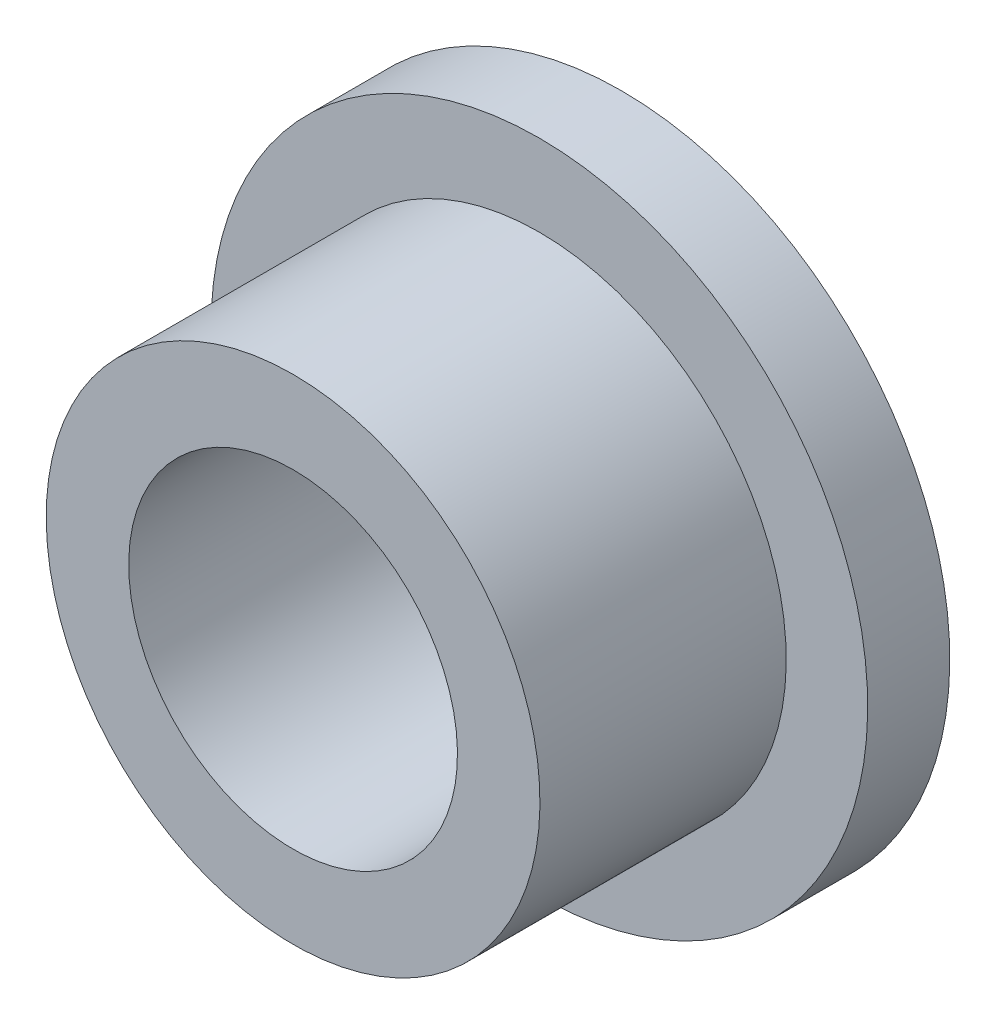
ISO-10303-21;
HEADER;
FILE_DESCRIPTION(('STEP AP214'),'2;1');
FILE_NAME('part.step','',(''),(''),'','','');
FILE_SCHEMA(('AUTOMOTIVE_DESIGN { 1 0 10303 214 1 1 1 1 }'));
ENDSEC;
DATA;
#1=APPLICATION_CONTEXT('core data for automotive mechanical design processes');
#2=APPLICATION_PROTOCOL_DEFINITION('international standard','automotive_design',2000,#1);
#3=PRODUCT_CONTEXT('',#1,'mechanical');
#4=PRODUCT('Part','Part','',(#3));
#5=PRODUCT_RELATED_PRODUCT_CATEGORY('part','',(#4));
#6=PRODUCT_DEFINITION_FORMATION('','',#4);
#7=PRODUCT_DEFINITION_CONTEXT('part definition',#1,'design');
#8=PRODUCT_DEFINITION('design','',#6,#7);
#9=PRODUCT_DEFINITION_SHAPE('','',#8);
#10=(LENGTH_UNIT() NAMED_UNIT(*) SI_UNIT(.MILLI.,.METRE.));
#11=(NAMED_UNIT(*) PLANE_ANGLE_UNIT() SI_UNIT($,.RADIAN.));
#12=(NAMED_UNIT(*) SI_UNIT($,.STERADIAN.) SOLID_ANGLE_UNIT());
#13=UNCERTAINTY_MEASURE_WITH_UNIT(LENGTH_MEASURE(1.E-05),#10,'distance_accuracy_value','');
#14=(GEOMETRIC_REPRESENTATION_CONTEXT(3) GLOBAL_UNCERTAINTY_ASSIGNED_CONTEXT((#13)) GLOBAL_UNIT_ASSIGNED_CONTEXT((#10,
#11,#12)) REPRESENTATION_CONTEXT('',''));
#15=CARTESIAN_POINT('',(0.,0.,0.));
#16=DIRECTION('',(0.,0.,1.));
#17=DIRECTION('',(1.,0.,0.));
#18=AXIS2_PLACEMENT_3D('',#15,#16,#17);
#19=CARTESIAN_POINT('',(0.,0.,0.));
#20=DIRECTION('',(0.,0.,1.));
#21=DIRECTION('',(0.,-1.,0.));
#22=AXIS2_PLACEMENT_3D('',#19,#20,#21);
#23=PLANE('',#22);
#24=CARTESIAN_POINT('',(0.,0.,0.));
#25=DIRECTION('',(0.,0.,-1.));
#26=DIRECTION('',(0.,1.,0.));
#27=AXIS2_PLACEMENT_3D('',#24,#25,#26);
#28=CIRCLE('',#27,4.005);
#29=CARTESIAN_POINT('',(0.,4.005,0.));
#30=VERTEX_POINT('',#29);
#31=EDGE_CURVE('E34',#30,#30,#28,.F.);
#32=ORIENTED_EDGE('',*,*,#31,.T.);
#33=EDGE_LOOP('',(#32));
#34=FACE_BOUND('',#33,.T.);
#35=CARTESIAN_POINT('',(0.,0.,0.));
#36=DIRECTION('',(0.,0.,-1.));
#37=DIRECTION('',(0.,1.,0.));
#38=AXIS2_PLACEMENT_3D('',#35,#36,#37);
#39=CIRCLE('',#38,8.);
#40=CARTESIAN_POINT('',(0.,8.,0.));
#41=VERTEX_POINT('',#40);
#42=EDGE_CURVE('E18',#41,#41,#39,.F.);
#43=ORIENTED_EDGE('',*,*,#42,.F.);
#44=EDGE_LOOP('',(#43));
#45=FACE_BOUND('',#44,.T.);
#46=ADVANCED_FACE('F15',(#34,#45),#23,.F.);
#47=CARTESIAN_POINT('',(0.,0.,2.));
#48=DIRECTION('',(0.,0.,-1.));
#49=DIRECTION('',(0.,1.,0.));
#50=AXIS2_PLACEMENT_3D('',#47,#48,#49);
#51=CYLINDRICAL_SURFACE('',#50,8.);
#52=CARTESIAN_POINT('',(0.,0.,2.));
#53=DIRECTION('',(0.,0.,-1.));
#54=DIRECTION('',(0.,1.,0.));
#55=AXIS2_PLACEMENT_3D('',#52,#53,#54);
#56=CIRCLE('',#55,8.);
#57=CARTESIAN_POINT('',(0.,8.,2.));
#58=VERTEX_POINT('',#57);
#59=EDGE_CURVE('E32',#58,#58,#56,.F.);
#60=ORIENTED_EDGE('',*,*,#59,.F.);
#61=EDGE_LOOP('',(#60));
#62=FACE_BOUND('',#61,.T.);
#63=ORIENTED_EDGE('',*,*,#42,.T.);
#64=EDGE_LOOP('',(#63));
#65=FACE_BOUND('',#64,.T.);
#66=ADVANCED_FACE('F41',(#62,#65),#51,.T.);
#67=CARTESIAN_POINT('',(0.,0.,8.));
#68=DIRECTION('',(0.,0.,-1.));
#69=DIRECTION('',(0.,1.,0.));
#70=AXIS2_PLACEMENT_3D('',#67,#68,#69);
#71=CYLINDRICAL_SURFACE('',#70,4.005);
#72=ORIENTED_EDGE('',*,*,#31,.F.);
#73=EDGE_LOOP('',(#72));
#74=FACE_BOUND('',#73,.T.);
#75=CARTESIAN_POINT('',(0.,0.,8.));
#76=DIRECTION('',(0.,0.,-1.));
#77=DIRECTION('',(0.,1.,0.));
#78=AXIS2_PLACEMENT_3D('',#75,#76,#77);
#79=CIRCLE('',#78,4.005);
#80=CARTESIAN_POINT('',(0.,4.005,8.));
#81=VERTEX_POINT('',#80);
#82=EDGE_CURVE('E27',#81,#81,#79,.T.);
#83=ORIENTED_EDGE('',*,*,#82,.F.);
#84=EDGE_LOOP('',(#83));
#85=FACE_BOUND('',#84,.T.);
#86=ADVANCED_FACE('F48',(#74,#85),#71,.F.);
#87=CARTESIAN_POINT('',(0.,0.,2.));
#88=DIRECTION('',(0.,0.,1.));
#89=DIRECTION('',(0.,-1.,0.));
#90=AXIS2_PLACEMENT_3D('',#87,#88,#89);
#91=PLANE('',#90);
#92=CARTESIAN_POINT('',(0.,0.,2.));
#93=DIRECTION('',(0.,0.,-1.));
#94=DIRECTION('',(0.,1.,0.));
#95=AXIS2_PLACEMENT_3D('',#92,#93,#94);
#96=CIRCLE('',#95,6.015);
#97=CARTESIAN_POINT('',(0.,6.015,2.));
#98=VERTEX_POINT('',#97);
#99=EDGE_CURVE('E22',#98,#98,#96,.F.);
#100=ORIENTED_EDGE('',*,*,#99,.F.);
#101=EDGE_LOOP('',(#100));
#102=FACE_BOUND('',#101,.T.);
#103=ORIENTED_EDGE('',*,*,#59,.T.);
#104=EDGE_LOOP('',(#103));
#105=FACE_BOUND('',#104,.T.);
#106=ADVANCED_FACE('F57',(#102,#105),#91,.T.);
#107=CARTESIAN_POINT('',(0.,0.,8.));
#108=DIRECTION('',(0.,0.,1.));
#109=DIRECTION('',(0.,-1.,0.));
#110=AXIS2_PLACEMENT_3D('',#107,#108,#109);
#111=PLANE('',#110);
#112=ORIENTED_EDGE('',*,*,#82,.T.);
#113=EDGE_LOOP('',(#112));
#114=FACE_BOUND('',#113,.T.);
#115=CARTESIAN_POINT('',(0.,0.,8.));
#116=DIRECTION('',(0.,0.,-1.));
#117=DIRECTION('',(0.,1.,0.));
#118=AXIS2_PLACEMENT_3D('',#115,#116,#117);
#119=CIRCLE('',#118,6.015);
#120=CARTESIAN_POINT('',(0.,6.015,8.));
#121=VERTEX_POINT('',#120);
#122=EDGE_CURVE('E10',#121,#121,#119,.T.);
#123=ORIENTED_EDGE('',*,*,#122,.F.);
#124=EDGE_LOOP('',(#123));
#125=FACE_BOUND('',#124,.T.);
#126=ADVANCED_FACE('F52',(#114,#125),#111,.T.);
#127=CARTESIAN_POINT('',(0.,0.,8.));
#128=DIRECTION('',(0.,0.,-1.));
#129=DIRECTION('',(0.,1.,0.));
#130=AXIS2_PLACEMENT_3D('',#127,#128,#129);
#131=CYLINDRICAL_SURFACE('',#130,6.015);
#132=ORIENTED_EDGE('',*,*,#122,.T.);
#133=EDGE_LOOP('',(#132));
#134=FACE_BOUND('',#133,.T.);
#135=ORIENTED_EDGE('',*,*,#99,.T.);
#136=EDGE_LOOP('',(#135));
#137=FACE_BOUND('',#136,.T.);
#138=ADVANCED_FACE('F50',(#134,#137),#131,.T.);
#139=CLOSED_SHELL('',(#46,#66,#86,#106,#126,#138));
#140=MANIFOLD_SOLID_BREP('B1',#139);
#141=ADVANCED_BREP_SHAPE_REPRESENTATION('',(#18,#140),#14);
#142=SHAPE_DEFINITION_REPRESENTATION(#9,#141);
ENDSEC;
END-ISO-10303-21;
